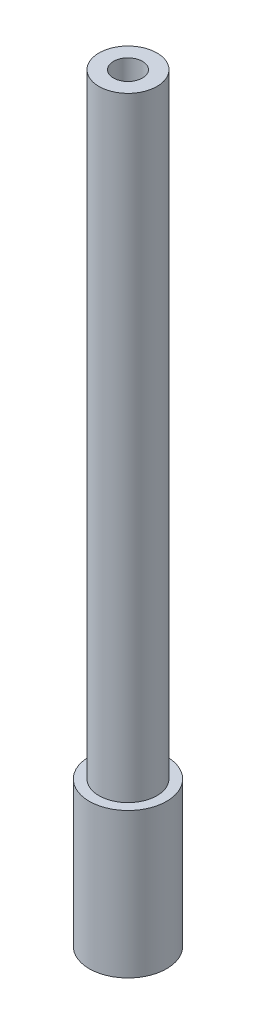
ISO-10303-21;
HEADER;
FILE_DESCRIPTION(('STEP AP214'),'2;1');
FILE_NAME('part.step','',(''),(''),'','','');
FILE_SCHEMA(('AUTOMOTIVE_DESIGN { 1 0 10303 214 1 1 1 1 }'));
ENDSEC;
DATA;
#1=APPLICATION_CONTEXT('core data for automotive mechanical design processes');
#2=APPLICATION_PROTOCOL_DEFINITION('international standard','automotive_design',2000,#1);
#3=PRODUCT_CONTEXT('',#1,'mechanical');
#4=PRODUCT('Part','Part','',(#3));
#5=PRODUCT_RELATED_PRODUCT_CATEGORY('part','',(#4));
#6=PRODUCT_DEFINITION_FORMATION('','',#4);
#7=PRODUCT_DEFINITION_CONTEXT('part definition',#1,'design');
#8=PRODUCT_DEFINITION('design','',#6,#7);
#9=PRODUCT_DEFINITION_SHAPE('','',#8);
#10=(LENGTH_UNIT() NAMED_UNIT(*) SI_UNIT(.MILLI.,.METRE.));
#11=(NAMED_UNIT(*) PLANE_ANGLE_UNIT() SI_UNIT($,.RADIAN.));
#12=(NAMED_UNIT(*) SI_UNIT($,.STERADIAN.) SOLID_ANGLE_UNIT());
#13=UNCERTAINTY_MEASURE_WITH_UNIT(LENGTH_MEASURE(1.E-05),#10,'distance_accuracy_value','');
#14=(GEOMETRIC_REPRESENTATION_CONTEXT(3) GLOBAL_UNCERTAINTY_ASSIGNED_CONTEXT((#13)) GLOBAL_UNIT_ASSIGNED_CONTEXT((#10,
#11,#12)) REPRESENTATION_CONTEXT('',''));
#15=CARTESIAN_POINT('',(0.,0.,0.));
#16=DIRECTION('',(0.,0.,1.));
#17=DIRECTION('',(1.,0.,0.));
#18=AXIS2_PLACEMENT_3D('',#15,#16,#17);
#19=CARTESIAN_POINT('',(0.,15.,0.));
#20=DIRECTION('',(0.,-1.,0.));
#21=DIRECTION('',(0.,0.,-1.));
#22=AXIS2_PLACEMENT_3D('',#19,#20,#21);
#23=CYLINDRICAL_SURFACE('',#22,4.);
#24=CARTESIAN_POINT('',(0.,15.,0.));
#25=DIRECTION('',(0.,1.,0.));
#26=DIRECTION('',(0.,0.,1.));
#27=AXIS2_PLACEMENT_3D('',#24,#25,#26);
#28=CIRCLE('',#27,4.);
#29=CARTESIAN_POINT('',(0.,15.,4.));
#30=VERTEX_POINT('',#29);
#31=EDGE_CURVE('E10',#30,#30,#28,.T.);
#32=ORIENTED_EDGE('',*,*,#31,.F.);
#33=EDGE_LOOP('',(#32));
#34=FACE_BOUND('',#33,.T.);
#35=CARTESIAN_POINT('',(0.,0.,0.));
#36=DIRECTION('',(0.,1.,0.));
#37=DIRECTION('',(0.,0.,1.));
#38=AXIS2_PLACEMENT_3D('',#35,#36,#37);
#39=CIRCLE('',#38,4.);
#40=CARTESIAN_POINT('',(0.,0.,4.));
#41=VERTEX_POINT('',#40);
#42=EDGE_CURVE('E34',#41,#41,#39,.T.);
#43=ORIENTED_EDGE('',*,*,#42,.T.);
#44=EDGE_LOOP('',(#43));
#45=FACE_BOUND('',#44,.T.);
#46=ADVANCED_FACE('F31',(#34,#45),#23,.T.);
#47=CARTESIAN_POINT('',(0.,15.,0.));
#48=DIRECTION('',(0.,1.,0.));
#49=DIRECTION('',(0.,0.,1.));
#50=AXIS2_PLACEMENT_3D('',#47,#48,#49);
#51=PLANE('',#50);
#52=CARTESIAN_POINT('',(0.,15.,0.));
#53=DIRECTION('',(0.,1.,0.));
#54=DIRECTION('',(0.,0.,1.));
#55=AXIS2_PLACEMENT_3D('',#52,#53,#54);
#56=CIRCLE('',#55,3.);
#57=CARTESIAN_POINT('',(0.,15.,3.));
#58=VERTEX_POINT('',#57);
#59=EDGE_CURVE('E41',#58,#58,#56,.T.);
#60=ORIENTED_EDGE('',*,*,#59,.F.);
#61=EDGE_LOOP('',(#60));
#62=FACE_BOUND('',#61,.T.);
#63=ORIENTED_EDGE('',*,*,#31,.T.);
#64=EDGE_LOOP('',(#63));
#65=FACE_BOUND('',#64,.T.);
#66=ADVANCED_FACE('F95',(#62,#65),#51,.T.);
#67=CARTESIAN_POINT('',(0.,0.,0.));
#68=DIRECTION('',(0.,1.,0.));
#69=DIRECTION('',(0.,0.,1.));
#70=AXIS2_PLACEMENT_3D('',#67,#68,#69);
#71=PLANE('',#70);
#72=CARTESIAN_POINT('',(0.,0.,0.));
#73=DIRECTION('',(0.,-1.,0.));
#74=DIRECTION('',(0.,0.,-1.));
#75=AXIS2_PLACEMENT_3D('',#72,#73,#74);
#76=CIRCLE('',#75,2.425);
#77=CARTESIAN_POINT('',(0.,0.,-2.425));
#78=VERTEX_POINT('',#77);
#79=EDGE_CURVE('E46',#78,#78,#76,.T.);
#80=ORIENTED_EDGE('',*,*,#79,.F.);
#81=EDGE_LOOP('',(#80));
#82=FACE_BOUND('',#81,.T.);
#83=ORIENTED_EDGE('',*,*,#42,.F.);
#84=EDGE_LOOP('',(#83));
#85=FACE_BOUND('',#84,.T.);
#86=ADVANCED_FACE('F85',(#82,#85),#71,.F.);
#87=CARTESIAN_POINT('',(0.,74.52,0.));
#88=DIRECTION('',(0.,-1.,0.));
#89=DIRECTION('',(0.,0.,-1.));
#90=AXIS2_PLACEMENT_3D('',#87,#88,#89);
#91=CYLINDRICAL_SURFACE('',#90,3.);
#92=ORIENTED_EDGE('',*,*,#59,.T.);
#93=EDGE_LOOP('',(#92));
#94=FACE_BOUND('',#93,.T.);
#95=CARTESIAN_POINT('',(0.,78.52,0.));
#96=DIRECTION('',(0.,1.,0.));
#97=DIRECTION('',(0.,0.,1.));
#98=AXIS2_PLACEMENT_3D('',#95,#96,#97);
#99=CIRCLE('',#98,3.);
#100=CARTESIAN_POINT('',(0.,78.52,3.));
#101=VERTEX_POINT('',#100);
#102=EDGE_CURVE('E55',#101,#101,#99,.T.);
#103=ORIENTED_EDGE('',*,*,#102,.F.);
#104=EDGE_LOOP('',(#103));
#105=FACE_BOUND('',#104,.T.);
#106=ADVANCED_FACE('F82',(#94,#105),#91,.T.);
#107=CARTESIAN_POINT('',(0.,4.,0.));
#108=DIRECTION('',(0.,-1.,0.));
#109=DIRECTION('',(0.,0.,-1.));
#110=AXIS2_PLACEMENT_3D('',#107,#108,#109);
#111=CYLINDRICAL_SURFACE('',#110,2.425);
#112=CARTESIAN_POINT('',(0.,4.,0.));
#113=DIRECTION('',(0.,-1.,0.));
#114=DIRECTION('',(0.,0.,-1.));
#115=AXIS2_PLACEMENT_3D('',#112,#113,#114);
#116=CIRCLE('',#115,2.425);
#117=CARTESIAN_POINT('',(0.,4.,-2.425));
#118=VERTEX_POINT('',#117);
#119=EDGE_CURVE('E45',#118,#118,#116,.T.);
#120=ORIENTED_EDGE('',*,*,#119,.F.);
#121=EDGE_LOOP('',(#120));
#122=FACE_BOUND('',#121,.T.);
#123=ORIENTED_EDGE('',*,*,#79,.T.);
#124=EDGE_LOOP('',(#123));
#125=FACE_BOUND('',#124,.T.);
#126=ADVANCED_FACE('F84',(#122,#125),#111,.F.);
#127=CARTESIAN_POINT('',(0.,4.,0.));
#128=DIRECTION('',(0.,-1.,0.));
#129=DIRECTION('',(0.,0.,-1.));
#130=AXIS2_PLACEMENT_3D('',#127,#128,#129);
#131=PLANE('',#130);
#132=CARTESIAN_POINT('',(0.,4.,0.));
#133=DIRECTION('',(0.,-1.,0.));
#134=DIRECTION('',(0.,0.,-1.));
#135=AXIS2_PLACEMENT_3D('',#132,#133,#134);
#136=CIRCLE('',#135,1.02);
#137=CARTESIAN_POINT('',(0.,4.,-1.02));
#138=VERTEX_POINT('',#137);
#139=EDGE_CURVE('E49',#138,#138,#136,.T.);
#140=ORIENTED_EDGE('',*,*,#139,.F.);
#141=EDGE_LOOP('',(#140));
#142=FACE_BOUND('',#141,.T.);
#143=ORIENTED_EDGE('',*,*,#119,.T.);
#144=EDGE_LOOP('',(#143));
#145=FACE_BOUND('',#144,.T.);
#146=ADVANCED_FACE('F92',(#142,#145),#131,.T.);
#147=CARTESIAN_POINT('',(0.,4.,0.));
#148=DIRECTION('',(0.,-1.,0.));
#149=DIRECTION('',(0.,0.,-1.));
#150=AXIS2_PLACEMENT_3D('',#147,#148,#149);
#151=CYLINDRICAL_SURFACE('',#150,1.02);
#152=ORIENTED_EDGE('',*,*,#139,.T.);
#153=EDGE_LOOP('',(#152));
#154=FACE_BOUND('',#153,.T.);
#155=CARTESIAN_POINT('',(0.,0.,0.));
#156=DIRECTION('',(0.,-1.,0.));
#157=DIRECTION('',(0.,0.,-1.));
#158=AXIS2_PLACEMENT_3D('',#155,#156,#157);
#159=CIRCLE('',#158,1.02);
#160=CARTESIAN_POINT('',(0.,0.,-1.02));
#161=VERTEX_POINT('',#160);
#162=EDGE_CURVE('E52',#161,#161,#159,.T.);
#163=ORIENTED_EDGE('',*,*,#162,.F.);
#164=EDGE_LOOP('',(#163));
#165=FACE_BOUND('',#164,.T.);
#166=ADVANCED_FACE('F131',(#154,#165),#151,.T.);
#167=ORIENTED_EDGE('',*,*,#162,.T.);
#168=EDGE_LOOP('',(#167));
#169=FACE_BOUND('',#168,.T.);
#170=ADVANCED_FACE('F78',(#169),#71,.F.);
#171=CARTESIAN_POINT('',(0.,78.52,0.));
#172=DIRECTION('',(0.,1.,0.));
#173=DIRECTION('',(0.,0.,1.));
#174=AXIS2_PLACEMENT_3D('',#171,#172,#173);
#175=PLANE('',#174);
#176=CARTESIAN_POINT('',(0.,78.52,0.));
#177=DIRECTION('',(0.,1.,0.));
#178=DIRECTION('',(0.,0.,1.));
#179=AXIS2_PLACEMENT_3D('',#176,#177,#178);
#180=CIRCLE('',#179,1.5);
#181=CARTESIAN_POINT('',(0.,78.52,1.5));
#182=VERTEX_POINT('',#181);
#183=EDGE_CURVE('E61',#182,#182,#180,.T.);
#184=ORIENTED_EDGE('',*,*,#183,.F.);
#185=EDGE_LOOP('',(#184));
#186=FACE_BOUND('',#185,.T.);
#187=ORIENTED_EDGE('',*,*,#102,.T.);
#188=EDGE_LOOP('',(#187));
#189=FACE_BOUND('',#188,.T.);
#190=ADVANCED_FACE('F72',(#186,#189),#175,.T.);
#191=CARTESIAN_POINT('',(0.,28.52,0.));
#192=DIRECTION('',(0.,1.,0.));
#193=DIRECTION('',(0.,0.,1.));
#194=AXIS2_PLACEMENT_3D('',#191,#192,#193);
#195=CYLINDRICAL_SURFACE('',#194,1.5);
#196=CARTESIAN_POINT('',(0.,28.52,0.));
#197=DIRECTION('',(0.,1.,0.));
#198=DIRECTION('',(0.,0.,1.));
#199=AXIS2_PLACEMENT_3D('',#196,#197,#198);
#200=CIRCLE('',#199,1.5);
#201=CARTESIAN_POINT('',(0.,28.52,1.5));
#202=VERTEX_POINT('',#201);
#203=EDGE_CURVE('E60',#202,#202,#200,.T.);
#204=ORIENTED_EDGE('',*,*,#203,.F.);
#205=EDGE_LOOP('',(#204));
#206=FACE_BOUND('',#205,.T.);
#207=ORIENTED_EDGE('',*,*,#183,.T.);
#208=EDGE_LOOP('',(#207));
#209=FACE_BOUND('',#208,.T.);
#210=ADVANCED_FACE('F69',(#206,#209),#195,.F.);
#211=CARTESIAN_POINT('',(0.,28.52,0.));
#212=DIRECTION('',(0.,1.,0.));
#213=DIRECTION('',(0.,0.,1.));
#214=AXIS2_PLACEMENT_3D('',#211,#212,#213);
#215=PLANE('',#214);
#216=ORIENTED_EDGE('',*,*,#203,.T.);
#217=EDGE_LOOP('',(#216));
#218=FACE_BOUND('',#217,.T.);
#219=ADVANCED_FACE('F67',(#218),#215,.T.);
#220=CLOSED_SHELL('',(#46,#66,#86,#106,#126,#146,#166,#170,#190,#210,#219));
#221=MANIFOLD_SOLID_BREP('B2',#220);
#222=ADVANCED_BREP_SHAPE_REPRESENTATION('',(#18,#221),#14);
#223=SHAPE_DEFINITION_REPRESENTATION(#9,#222);
ENDSEC;
END-ISO-10303-21;
